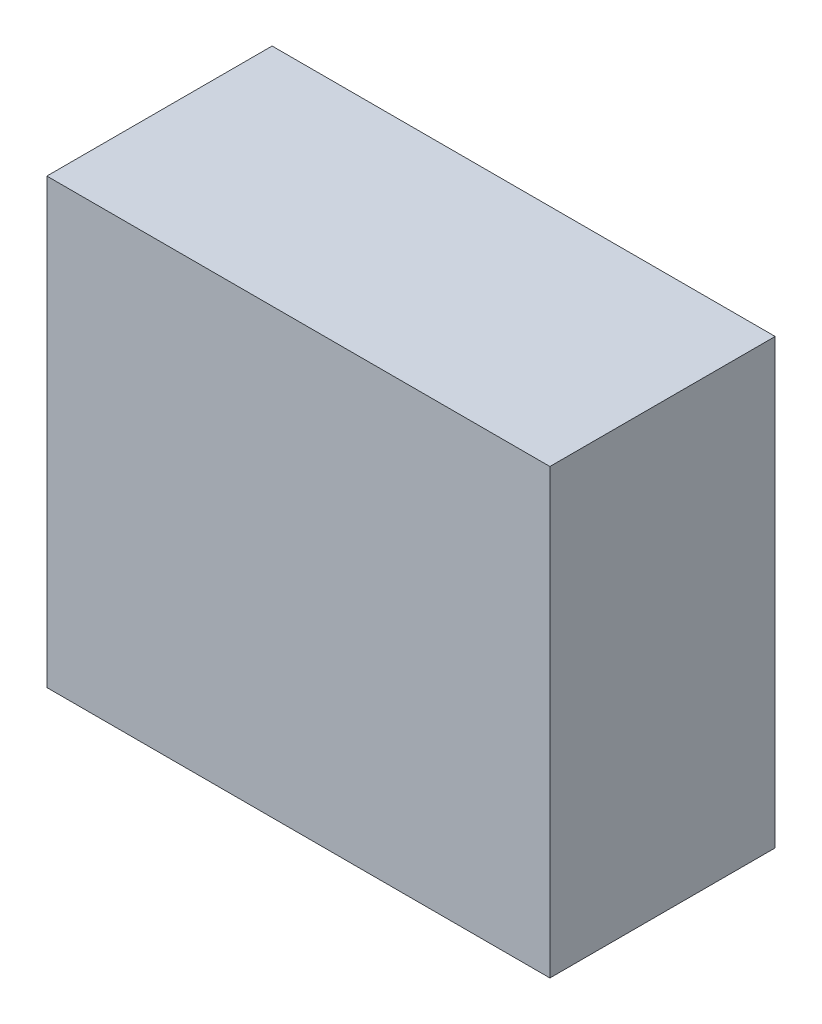
ISO-10303-21;
HEADER;
FILE_DESCRIPTION(('STEP AP214'),'2;1');
FILE_NAME('part.step','',(''),(''),'','','');
FILE_SCHEMA(('AUTOMOTIVE_DESIGN { 1 0 10303 214 1 1 1 1 }'));
ENDSEC;
DATA;
#1=APPLICATION_CONTEXT('core data for automotive mechanical design processes');
#2=APPLICATION_PROTOCOL_DEFINITION('international standard','automotive_design',2000,#1);
#3=PRODUCT_CONTEXT('',#1,'mechanical');
#4=PRODUCT('Part','Part','',(#3));
#5=PRODUCT_RELATED_PRODUCT_CATEGORY('part','',(#4));
#6=PRODUCT_DEFINITION_FORMATION('','',#4);
#7=PRODUCT_DEFINITION_CONTEXT('part definition',#1,'design');
#8=PRODUCT_DEFINITION('design','',#6,#7);
#9=PRODUCT_DEFINITION_SHAPE('','',#8);
#10=(LENGTH_UNIT() NAMED_UNIT(*) SI_UNIT(.MILLI.,.METRE.));
#11=(NAMED_UNIT(*) PLANE_ANGLE_UNIT() SI_UNIT($,.RADIAN.));
#12=(NAMED_UNIT(*) SI_UNIT($,.STERADIAN.) SOLID_ANGLE_UNIT());
#13=UNCERTAINTY_MEASURE_WITH_UNIT(LENGTH_MEASURE(1.E-05),#10,'distance_accuracy_value','');
#14=(GEOMETRIC_REPRESENTATION_CONTEXT(3) GLOBAL_UNCERTAINTY_ASSIGNED_CONTEXT((#13)) GLOBAL_UNIT_ASSIGNED_CONTEXT((#10,
#11,#12)) REPRESENTATION_CONTEXT('',''));
#15=CARTESIAN_POINT('',(0.,0.,0.));
#16=DIRECTION('',(0.,0.,1.));
#17=DIRECTION('',(1.,0.,0.));
#18=AXIS2_PLACEMENT_3D('',#15,#16,#17);
#19=CARTESIAN_POINT('',(3.35000092,-2.95000172,2.99999908));
#20=DIRECTION('',(0.,0.,1.));
#21=DIRECTION('',(1.,0.,0.));
#22=AXIS2_PLACEMENT_3D('',#19,#20,#21);
#23=PLANE('',#22);
#24=DIRECTION('',(0.,1.,0.));
#25=VECTOR('',#24,1.);
#26=CARTESIAN_POINT('',(-3.35000092,-2.94999918,2.99999908));
#27=LINE('',#26,#25);
#28=CARTESIAN_POINT('',(-3.35000092,-2.94999918,2.99999908));
#29=VERTEX_POINT('',#28);
#30=CARTESIAN_POINT('',(-3.35000092,2.95000045,2.99999908));
#31=VERTEX_POINT('',#30);
#32=EDGE_CURVE('E52',#29,#31,#27,.T.);
#33=ORIENTED_EDGE('',*,*,#32,.F.);
#34=DIRECTION('',(0.999999999999928,-3.79104373051573E-07,0.));
#35=VECTOR('',#34,1.);
#36=CARTESIAN_POINT('',(3.35000092,-2.95000172,2.99999908));
#37=LINE('',#36,#35);
#38=CARTESIAN_POINT('',(3.35000092,-2.950001085,2.99999908));
#39=VERTEX_POINT('',#38);
#40=EDGE_CURVE('E67',#39,#29,#37,.F.);
#41=ORIENTED_EDGE('',*,*,#40,.F.);
#42=DIRECTION('',(0.,1.,0.));
#43=VECTOR('',#42,1.);
#44=CARTESIAN_POINT('',(3.35000092,2.95000172,2.99999908));
#45=LINE('',#44,#43);
#46=CARTESIAN_POINT('',(3.35000092,2.95000172,2.99999908));
#47=VERTEX_POINT('',#46);
#48=EDGE_CURVE('E19',#47,#39,#45,.F.);
#49=ORIENTED_EDGE('',*,*,#48,.F.);
#50=DIRECTION('',(-0.999999999999928,-3.79104373051573E-07,0.));
#51=VECTOR('',#50,1.);
#52=CARTESIAN_POINT('',(-3.35000092,2.94999918,2.99999908));
#53=LINE('',#52,#51);
#54=EDGE_CURVE('E57',#31,#47,#53,.F.);
#55=ORIENTED_EDGE('',*,*,#54,.F.);
#56=EDGE_LOOP('',(#33,#41,#49,#55));
#57=FACE_BOUND('',#56,.T.);
#58=ADVANCED_FACE('F16',(#57),#23,.T.);
#59=CARTESIAN_POINT('',(3.35000092,2.95000172,0.));
#60=DIRECTION('',(1.,0.,0.));
#61=DIRECTION('',(0.,0.,-1.));
#62=AXIS2_PLACEMENT_3D('',#59,#60,#61);
#63=PLANE('',#62);
#64=DIRECTION('',(0.,0.,1.));
#65=VECTOR('',#64,1.);
#66=CARTESIAN_POINT('',(3.35000092,-2.95000172,0.));
#67=LINE('',#66,#65);
#68=CARTESIAN_POINT('',(3.35000092,-2.950001085,0.));
#69=VERTEX_POINT('',#68);
#70=EDGE_CURVE('E78',#69,#39,#67,.T.);
#71=ORIENTED_EDGE('',*,*,#70,.F.);
#72=DIRECTION('',(0.,1.,0.));
#73=VECTOR('',#72,1.);
#74=CARTESIAN_POINT('',(3.35000092,-2.95000172,0.));
#75=LINE('',#74,#73);
#76=CARTESIAN_POINT('',(3.35000092,2.95000172,0.));
#77=VERTEX_POINT('',#76);
#78=EDGE_CURVE('E73',#69,#77,#75,.T.);
#79=ORIENTED_EDGE('',*,*,#78,.T.);
#80=DIRECTION('',(0.,0.,1.));
#81=VECTOR('',#80,1.);
#82=CARTESIAN_POINT('',(3.35000092,2.95000172,0.));
#83=LINE('',#82,#81);
#84=EDGE_CURVE('E62',#47,#77,#83,.F.);
#85=ORIENTED_EDGE('',*,*,#84,.F.);
#86=ORIENTED_EDGE('',*,*,#48,.T.);
#87=EDGE_LOOP('',(#71,#79,#85,#86));
#88=FACE_BOUND('',#87,.T.);
#89=ADVANCED_FACE('F72',(#88),#63,.T.);
#90=CARTESIAN_POINT('',(-3.35000092,2.94999918,0.));
#91=DIRECTION('',(-3.79104373051573E-07,0.999999999999928,0.));
#92=DIRECTION('',(-0.999999999999928,-3.79104373051573E-07,0.));
#93=AXIS2_PLACEMENT_3D('',#90,#91,#92);
#94=PLANE('',#93);
#95=ORIENTED_EDGE('',*,*,#84,.T.);
#96=DIRECTION('',(1.,0.,0.));
#97=VECTOR('',#96,1.);
#98=CARTESIAN_POINT('',(3.35000092,2.95000172,0.));
#99=LINE('',#98,#97);
#100=CARTESIAN_POINT('',(-3.35000092,2.949999815,0.));
#101=VERTEX_POINT('',#100);
#102=EDGE_CURVE('E83',#77,#101,#99,.F.);
#103=ORIENTED_EDGE('',*,*,#102,.T.);
#104=DIRECTION('',(0.,0.,1.));
#105=VECTOR('',#104,1.);
#106=CARTESIAN_POINT('',(-3.35000092,2.94999918,0.));
#107=LINE('',#106,#105);
#108=EDGE_CURVE('E64',#31,#101,#107,.F.);
#109=ORIENTED_EDGE('',*,*,#108,.F.);
#110=ORIENTED_EDGE('',*,*,#54,.T.);
#111=EDGE_LOOP('',(#95,#103,#109,#110));
#112=FACE_BOUND('',#111,.T.);
#113=ADVANCED_FACE('F59',(#112),#94,.T.);
#114=CARTESIAN_POINT('',(-3.35000092,-2.94999918,0.));
#115=DIRECTION('',(-1.,0.,0.));
#116=DIRECTION('',(0.,0.,1.));
#117=AXIS2_PLACEMENT_3D('',#114,#115,#116);
#118=PLANE('',#117);
#119=ORIENTED_EDGE('',*,*,#108,.T.);
#120=DIRECTION('',(0.,1.,0.));
#121=VECTOR('',#120,1.);
#122=CARTESIAN_POINT('',(-3.35000092,-2.95000172,0.));
#123=LINE('',#122,#121);
#124=CARTESIAN_POINT('',(-3.35000092,-2.94999918,0.));
#125=VERTEX_POINT('',#124);
#126=EDGE_CURVE('E25',#101,#125,#123,.F.);
#127=ORIENTED_EDGE('',*,*,#126,.T.);
#128=DIRECTION('',(0.,0.,1.));
#129=VECTOR('',#128,1.);
#130=CARTESIAN_POINT('',(-3.35000092,-2.94999918,0.));
#131=LINE('',#130,#129);
#132=EDGE_CURVE('E33',#29,#125,#131,.F.);
#133=ORIENTED_EDGE('',*,*,#132,.F.);
#134=ORIENTED_EDGE('',*,*,#32,.T.);
#135=EDGE_LOOP('',(#119,#127,#133,#134));
#136=FACE_BOUND('',#135,.T.);
#137=ADVANCED_FACE('F87',(#136),#118,.T.);
#138=CARTESIAN_POINT('',(3.35000092,-2.95000172,0.));
#139=DIRECTION('',(-3.79104373051573E-07,-0.999999999999928,0.));
#140=DIRECTION('',(0.999999999999928,-3.79104373051573E-07,0.));
#141=AXIS2_PLACEMENT_3D('',#138,#139,#140);
#142=PLANE('',#141);
#143=ORIENTED_EDGE('',*,*,#132,.T.);
#144=DIRECTION('',(1.,0.,0.));
#145=VECTOR('',#144,1.);
#146=CARTESIAN_POINT('',(3.35000092,-2.94999918,0.));
#147=LINE('',#146,#145);
#148=EDGE_CURVE('E11',#125,#69,#147,.T.);
#149=ORIENTED_EDGE('',*,*,#148,.T.);
#150=ORIENTED_EDGE('',*,*,#70,.T.);
#151=ORIENTED_EDGE('',*,*,#40,.T.);
#152=EDGE_LOOP('',(#143,#149,#150,#151));
#153=FACE_BOUND('',#152,.T.);
#154=ADVANCED_FACE('F90',(#153),#142,.T.);
#155=CARTESIAN_POINT('',(3.35000092,-2.95000172,0.));
#156=DIRECTION('',(0.,0.,1.));
#157=DIRECTION('',(1.,0.,0.));
#158=AXIS2_PLACEMENT_3D('',#155,#156,#157);
#159=PLANE('',#158);
#160=ORIENTED_EDGE('',*,*,#126,.F.);
#161=ORIENTED_EDGE('',*,*,#102,.F.);
#162=ORIENTED_EDGE('',*,*,#78,.F.);
#163=ORIENTED_EDGE('',*,*,#148,.F.);
#164=EDGE_LOOP('',(#160,#161,#162,#163));
#165=FACE_BOUND('',#164,.T.);
#166=ADVANCED_FACE('F89',(#165),#159,.F.);
#167=CLOSED_SHELL('',(#58,#89,#113,#137,#154,#166));
#168=MANIFOLD_SOLID_BREP('B1',#167);
#169=ADVANCED_BREP_SHAPE_REPRESENTATION('',(#18,#168),#14);
#170=SHAPE_DEFINITION_REPRESENTATION(#9,#169);
ENDSEC;
END-ISO-10303-21;
